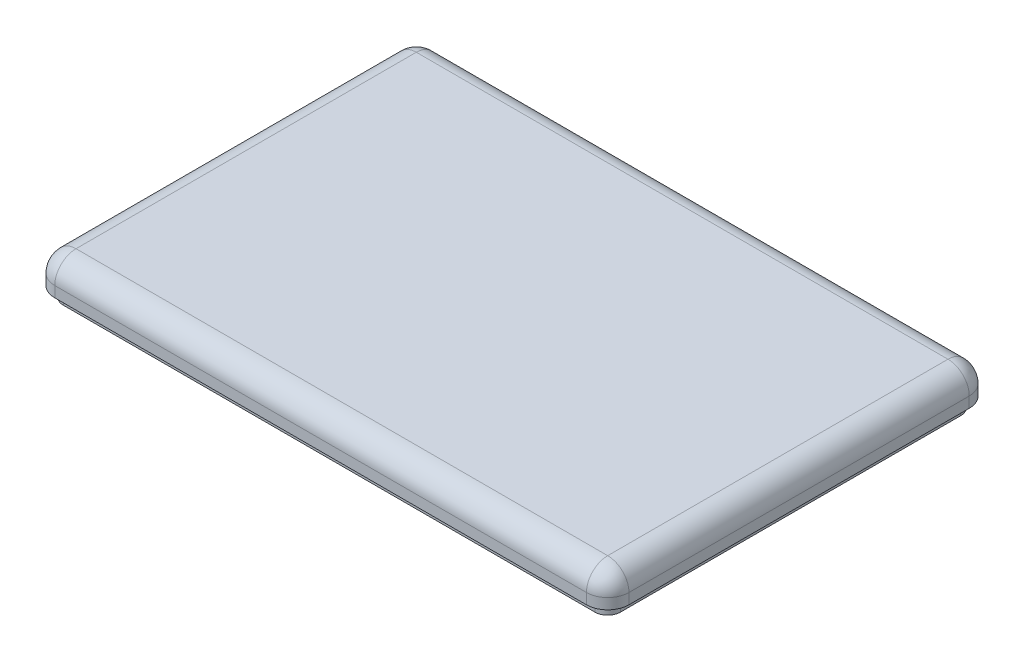
ISO-10303-21;
HEADER;
FILE_DESCRIPTION(('STEP AP214'),'2;1');
FILE_NAME('part.step','',(''),(''),'','','');
FILE_SCHEMA(('AUTOMOTIVE_DESIGN { 1 0 10303 214 1 1 1 1 }'));
ENDSEC;
DATA;
#1=APPLICATION_CONTEXT('core data for automotive mechanical design processes');
#2=APPLICATION_PROTOCOL_DEFINITION('international standard','automotive_design',2000,#1);
#3=PRODUCT_CONTEXT('',#1,'mechanical');
#4=PRODUCT('Part','Part','',(#3));
#5=PRODUCT_RELATED_PRODUCT_CATEGORY('part','',(#4));
#6=PRODUCT_DEFINITION_FORMATION('','',#4);
#7=PRODUCT_DEFINITION_CONTEXT('part definition',#1,'design');
#8=PRODUCT_DEFINITION('design','',#6,#7);
#9=PRODUCT_DEFINITION_SHAPE('','',#8);
#10=(LENGTH_UNIT() NAMED_UNIT(*) SI_UNIT(.MILLI.,.METRE.));
#11=(NAMED_UNIT(*) PLANE_ANGLE_UNIT() SI_UNIT($,.RADIAN.));
#12=(NAMED_UNIT(*) SI_UNIT($,.STERADIAN.) SOLID_ANGLE_UNIT());
#13=UNCERTAINTY_MEASURE_WITH_UNIT(LENGTH_MEASURE(1.E-05),#10,'distance_accuracy_value','');
#14=(GEOMETRIC_REPRESENTATION_CONTEXT(3) GLOBAL_UNCERTAINTY_ASSIGNED_CONTEXT((#13)) GLOBAL_UNIT_ASSIGNED_CONTEXT((#10,
#11,#12)) REPRESENTATION_CONTEXT('',''));
#15=CARTESIAN_POINT('',(0.,0.,0.));
#16=DIRECTION('',(0.,0.,1.));
#17=DIRECTION('',(1.,0.,0.));
#18=AXIS2_PLACEMENT_3D('',#15,#16,#17);
#19=CARTESIAN_POINT('',(135.,20.,90.));
#20=DIRECTION('',(-1.,0.,0.));
#21=DIRECTION('',(0.,0.,1.));
#22=AXIS2_PLACEMENT_3D('',#19,#20,#21);
#23=PLANE('',#22);
#24=DIRECTION('',(0.,0.,1.));
#25=VECTOR('',#24,1.);
#26=CARTESIAN_POINT('',(135.,5.,-80.));
#27=LINE('',#26,#25);
#28=CARTESIAN_POINT('',(135.,5.,-80.));
#29=VERTEX_POINT('',#28);
#30=CARTESIAN_POINT('',(135.,5.,80.));
#31=VERTEX_POINT('',#30);
#32=EDGE_CURVE('E248',#29,#31,#27,.T.);
#33=ORIENTED_EDGE('',*,*,#32,.F.);
#34=DIRECTION('',(0.,-1.,0.));
#35=VECTOR('',#34,1.);
#36=CARTESIAN_POINT('',(135.,20.,-80.));
#37=LINE('',#36,#35);
#38=CARTESIAN_POINT('',(135.,10.,-80.));
#39=VERTEX_POINT('',#38);
#40=EDGE_CURVE('E277',#29,#39,#37,.F.);
#41=ORIENTED_EDGE('',*,*,#40,.T.);
#42=DIRECTION('',(0.,0.,-1.));
#43=VECTOR('',#42,1.);
#44=CARTESIAN_POINT('',(135.,10.,90.));
#45=LINE('',#44,#43);
#46=CARTESIAN_POINT('',(135.,10.,80.));
#47=VERTEX_POINT('',#46);
#48=EDGE_CURVE('E272',#39,#47,#45,.F.);
#49=ORIENTED_EDGE('',*,*,#48,.T.);
#50=DIRECTION('',(0.,-1.,0.));
#51=VECTOR('',#50,1.);
#52=CARTESIAN_POINT('',(135.,20.,80.));
#53=LINE('',#52,#51);
#54=EDGE_CURVE('E274',#47,#31,#53,.T.);
#55=ORIENTED_EDGE('',*,*,#54,.T.);
#56=EDGE_LOOP('',(#33,#41,#49,#55));
#57=FACE_BOUND('',#56,.T.);
#58=ADVANCED_FACE('F35',(#57),#23,.F.);
#59=CARTESIAN_POINT('',(-135.,20.,-90.));
#60=DIRECTION('',(0.,0.,1.));
#61=DIRECTION('',(1.,0.,0.));
#62=AXIS2_PLACEMENT_3D('',#59,#60,#61);
#63=PLANE('',#62);
#64=DIRECTION('',(1.,0.,0.));
#65=VECTOR('',#64,1.);
#66=CARTESIAN_POINT('',(-125.,5.,-90.));
#67=LINE('',#66,#65);
#68=CARTESIAN_POINT('',(-125.,5.,-90.));
#69=VERTEX_POINT('',#68);
#70=CARTESIAN_POINT('',(125.,5.,-90.));
#71=VERTEX_POINT('',#70);
#72=EDGE_CURVE('E244',#69,#71,#67,.T.);
#73=ORIENTED_EDGE('',*,*,#72,.F.);
#74=DIRECTION('',(0.,-1.,0.));
#75=VECTOR('',#74,1.);
#76=CARTESIAN_POINT('',(-125.,20.,-90.));
#77=LINE('',#76,#75);
#78=CARTESIAN_POINT('',(-125.,10.,-90.));
#79=VERTEX_POINT('',#78);
#80=EDGE_CURVE('E270',#69,#79,#77,.F.);
#81=ORIENTED_EDGE('',*,*,#80,.T.);
#82=DIRECTION('',(-1.,0.,0.));
#83=VECTOR('',#82,1.);
#84=CARTESIAN_POINT('',(-135.,10.,-90.));
#85=LINE('',#84,#83);
#86=CARTESIAN_POINT('',(125.,10.,-90.));
#87=VERTEX_POINT('',#86);
#88=EDGE_CURVE('E265',#79,#87,#85,.F.);
#89=ORIENTED_EDGE('',*,*,#88,.T.);
#90=DIRECTION('',(0.,-1.,0.));
#91=VECTOR('',#90,1.);
#92=CARTESIAN_POINT('',(125.,20.,-90.));
#93=LINE('',#92,#91);
#94=EDGE_CURVE('E267',#87,#71,#93,.T.);
#95=ORIENTED_EDGE('',*,*,#94,.T.);
#96=EDGE_LOOP('',(#73,#81,#89,#95));
#97=FACE_BOUND('',#96,.T.);
#98=ADVANCED_FACE('F329',(#97),#63,.F.);
#99=CARTESIAN_POINT('',(-135.,20.,90.));
#100=DIRECTION('',(1.,0.,0.));
#101=DIRECTION('',(0.,0.,-1.));
#102=AXIS2_PLACEMENT_3D('',#99,#100,#101);
#103=PLANE('',#102);
#104=DIRECTION('',(0.,0.,-1.));
#105=VECTOR('',#104,1.);
#106=CARTESIAN_POINT('',(-135.,5.,80.));
#107=LINE('',#106,#105);
#108=CARTESIAN_POINT('',(-135.,5.,80.));
#109=VERTEX_POINT('',#108);
#110=CARTESIAN_POINT('',(-135.,5.,-79.9999999999999));
#111=VERTEX_POINT('',#110);
#112=EDGE_CURVE('E240',#109,#111,#107,.T.);
#113=ORIENTED_EDGE('',*,*,#112,.F.);
#114=DIRECTION('',(0.,-1.,0.));
#115=VECTOR('',#114,1.);
#116=CARTESIAN_POINT('',(-135.,20.,80.));
#117=LINE('',#116,#115);
#118=CARTESIAN_POINT('',(-135.,10.,80.));
#119=VERTEX_POINT('',#118);
#120=EDGE_CURVE('E263',#109,#119,#117,.F.);
#121=ORIENTED_EDGE('',*,*,#120,.T.);
#122=DIRECTION('',(0.,0.,1.));
#123=VECTOR('',#122,1.);
#124=CARTESIAN_POINT('',(-135.,10.,90.));
#125=LINE('',#124,#123);
#126=CARTESIAN_POINT('',(-135.,10.,-80.));
#127=VERTEX_POINT('',#126);
#128=EDGE_CURVE('E258',#119,#127,#125,.F.);
#129=ORIENTED_EDGE('',*,*,#128,.T.);
#130=DIRECTION('',(0.,-1.,0.));
#131=VECTOR('',#130,1.);
#132=CARTESIAN_POINT('',(-135.,20.,-80.));
#133=LINE('',#132,#131);
#134=EDGE_CURVE('E260',#127,#111,#133,.T.);
#135=ORIENTED_EDGE('',*,*,#134,.T.);
#136=EDGE_LOOP('',(#113,#121,#129,#135));
#137=FACE_BOUND('',#136,.T.);
#138=ADVANCED_FACE('F377',(#137),#103,.F.);
#139=CARTESIAN_POINT('',(-135.,20.,90.));
#140=DIRECTION('',(0.,0.,-1.));
#141=DIRECTION('',(-1.,0.,0.));
#142=AXIS2_PLACEMENT_3D('',#139,#140,#141);
#143=PLANE('',#142);
#144=DIRECTION('',(-1.,0.,0.));
#145=VECTOR('',#144,1.);
#146=CARTESIAN_POINT('',(125.,5.,90.));
#147=LINE('',#146,#145);
#148=CARTESIAN_POINT('',(125.,5.,90.));
#149=VERTEX_POINT('',#148);
#150=CARTESIAN_POINT('',(-125.,5.,90.));
#151=VERTEX_POINT('',#150);
#152=EDGE_CURVE('E60',#149,#151,#147,.T.);
#153=ORIENTED_EDGE('',*,*,#152,.F.);
#154=DIRECTION('',(0.,-1.,0.));
#155=VECTOR('',#154,1.);
#156=CARTESIAN_POINT('',(125.,20.,90.));
#157=LINE('',#156,#155);
#158=CARTESIAN_POINT('',(125.,10.,90.));
#159=VERTEX_POINT('',#158);
#160=EDGE_CURVE('E253',#149,#159,#157,.F.);
#161=ORIENTED_EDGE('',*,*,#160,.T.);
#162=DIRECTION('',(1.,0.,0.));
#163=VECTOR('',#162,1.);
#164=CARTESIAN_POINT('',(-135.,10.,90.));
#165=LINE('',#164,#163);
#166=CARTESIAN_POINT('',(-125.,10.,90.));
#167=VERTEX_POINT('',#166);
#168=EDGE_CURVE('E251',#159,#167,#165,.F.);
#169=ORIENTED_EDGE('',*,*,#168,.T.);
#170=DIRECTION('',(0.,-1.,0.));
#171=VECTOR('',#170,1.);
#172=CARTESIAN_POINT('',(-125.,20.,90.));
#173=LINE('',#172,#171);
#174=EDGE_CURVE('E255',#167,#151,#173,.T.);
#175=ORIENTED_EDGE('',*,*,#174,.T.);
#176=EDGE_LOOP('',(#153,#161,#169,#175));
#177=FACE_BOUND('',#176,.T.);
#178=ADVANCED_FACE('F370',(#177),#143,.F.);
#179=CARTESIAN_POINT('',(125.,20.,-80.));
#180=DIRECTION('',(0.,-1.,0.));
#181=DIRECTION('',(0.,0.,-1.));
#182=AXIS2_PLACEMENT_3D('',#179,#180,#181);
#183=CYLINDRICAL_SURFACE('',#182,10.);
#184=ORIENTED_EDGE('',*,*,#40,.F.);
#185=CARTESIAN_POINT('',(125.,5.,-80.));
#186=DIRECTION('',(0.,-1.,0.));
#187=DIRECTION('',(0.,0.,-1.));
#188=AXIS2_PLACEMENT_3D('',#185,#186,#187);
#189=CIRCLE('',#188,10.);
#190=EDGE_CURVE('E246',#71,#29,#189,.T.);
#191=ORIENTED_EDGE('',*,*,#190,.F.);
#192=ORIENTED_EDGE('',*,*,#94,.F.);
#193=CARTESIAN_POINT('',(125.,10.,-80.));
#194=DIRECTION('',(0.,1.,0.));
#195=DIRECTION('',(0.,0.,1.));
#196=AXIS2_PLACEMENT_3D('',#193,#194,#195);
#197=CIRCLE('',#196,10.);
#198=EDGE_CURVE('E39',#39,#87,#197,.T.);
#199=ORIENTED_EDGE('',*,*,#198,.F.);
#200=EDGE_LOOP('',(#184,#191,#192,#199));
#201=FACE_BOUND('',#200,.T.);
#202=ADVANCED_FACE('F37',(#201),#183,.T.);
#203=CARTESIAN_POINT('',(-125.,20.,-80.));
#204=DIRECTION('',(0.,-1.,0.));
#205=DIRECTION('',(0.,0.,-1.));
#206=AXIS2_PLACEMENT_3D('',#203,#204,#205);
#207=CYLINDRICAL_SURFACE('',#206,10.);
#208=ORIENTED_EDGE('',*,*,#80,.F.);
#209=CARTESIAN_POINT('',(-125.,5.,-80.));
#210=DIRECTION('',(0.,-1.,0.));
#211=DIRECTION('',(0.,0.,-1.));
#212=AXIS2_PLACEMENT_3D('',#209,#210,#211);
#213=CIRCLE('',#212,10.);
#214=EDGE_CURVE('E242',#111,#69,#213,.T.);
#215=ORIENTED_EDGE('',*,*,#214,.F.);
#216=ORIENTED_EDGE('',*,*,#134,.F.);
#217=CARTESIAN_POINT('',(-125.,10.,-80.));
#218=DIRECTION('',(0.,1.,0.));
#219=DIRECTION('',(0.,0.,1.));
#220=AXIS2_PLACEMENT_3D('',#217,#218,#219);
#221=CIRCLE('',#220,10.);
#222=EDGE_CURVE('E307',#79,#127,#221,.T.);
#223=ORIENTED_EDGE('',*,*,#222,.F.);
#224=EDGE_LOOP('',(#208,#215,#216,#223));
#225=FACE_BOUND('',#224,.T.);
#226=ADVANCED_FACE('F337',(#225),#207,.T.);
#227=CARTESIAN_POINT('',(125.,20.,80.));
#228=DIRECTION('',(0.,-1.,0.));
#229=DIRECTION('',(0.,0.,-1.));
#230=AXIS2_PLACEMENT_3D('',#227,#228,#229);
#231=CYLINDRICAL_SURFACE('',#230,10.);
#232=ORIENTED_EDGE('',*,*,#160,.F.);
#233=CARTESIAN_POINT('',(125.,5.,80.));
#234=DIRECTION('',(0.,-1.,0.));
#235=DIRECTION('',(0.,0.,-1.));
#236=AXIS2_PLACEMENT_3D('',#233,#234,#235);
#237=CIRCLE('',#236,9.99999999999999);
#238=EDGE_CURVE('E224',#31,#149,#237,.T.);
#239=ORIENTED_EDGE('',*,*,#238,.F.);
#240=ORIENTED_EDGE('',*,*,#54,.F.);
#241=CARTESIAN_POINT('',(125.,10.,80.));
#242=DIRECTION('',(0.,1.,0.));
#243=DIRECTION('',(0.,0.,1.));
#244=AXIS2_PLACEMENT_3D('',#241,#242,#243);
#245=CIRCLE('',#244,10.);
#246=EDGE_CURVE('E298',#159,#47,#245,.T.);
#247=ORIENTED_EDGE('',*,*,#246,.F.);
#248=EDGE_LOOP('',(#232,#239,#240,#247));
#249=FACE_BOUND('',#248,.T.);
#250=ADVANCED_FACE('F368',(#249),#231,.T.);
#251=CARTESIAN_POINT('',(-125.,20.,80.));
#252=DIRECTION('',(0.,-1.,0.));
#253=DIRECTION('',(0.,0.,-1.));
#254=AXIS2_PLACEMENT_3D('',#251,#252,#253);
#255=CYLINDRICAL_SURFACE('',#254,10.);
#256=ORIENTED_EDGE('',*,*,#120,.F.);
#257=CARTESIAN_POINT('',(-125.,5.,80.));
#258=DIRECTION('',(0.,-1.,0.));
#259=DIRECTION('',(0.,0.,-1.));
#260=AXIS2_PLACEMENT_3D('',#257,#258,#259);
#261=CIRCLE('',#260,10.);
#262=EDGE_CURVE('E238',#151,#109,#261,.T.);
#263=ORIENTED_EDGE('',*,*,#262,.F.);
#264=ORIENTED_EDGE('',*,*,#174,.F.);
#265=CARTESIAN_POINT('',(-125.,10.,80.));
#266=DIRECTION('',(0.,1.,0.));
#267=DIRECTION('',(0.,0.,1.));
#268=AXIS2_PLACEMENT_3D('',#265,#266,#267);
#269=CIRCLE('',#268,10.);
#270=EDGE_CURVE('E250',#167,#119,#269,.F.);
#271=ORIENTED_EDGE('',*,*,#270,.T.);
#272=EDGE_LOOP('',(#256,#263,#264,#271));
#273=FACE_BOUND('',#272,.T.);
#274=ADVANCED_FACE('F374',(#273),#255,.T.);
#275=CARTESIAN_POINT('',(0.,20.,0.));
#276=DIRECTION('',(0.,-1.,0.));
#277=DIRECTION('',(0.,0.,-1.));
#278=AXIS2_PLACEMENT_3D('',#275,#276,#277);
#279=PLANE('',#278);
#280=DIRECTION('',(1.,0.,0.));
#281=VECTOR('',#280,1.);
#282=CARTESIAN_POINT('',(0.,20.,80.));
#283=LINE('',#282,#281);
#284=CARTESIAN_POINT('',(-125.,20.,80.));
#285=VERTEX_POINT('',#284);
#286=CARTESIAN_POINT('',(125.,20.,80.));
#287=VERTEX_POINT('',#286);
#288=EDGE_CURVE('E279',#285,#287,#283,.T.);
#289=ORIENTED_EDGE('',*,*,#288,.T.);
#290=DIRECTION('',(0.,0.,-1.));
#291=VECTOR('',#290,1.);
#292=CARTESIAN_POINT('',(125.,20.,0.));
#293=LINE('',#292,#291);
#294=CARTESIAN_POINT('',(125.,20.,-80.));
#295=VERTEX_POINT('',#294);
#296=EDGE_CURVE('E11',#287,#295,#293,.T.);
#297=ORIENTED_EDGE('',*,*,#296,.T.);
#298=DIRECTION('',(-1.,0.,0.));
#299=VECTOR('',#298,1.);
#300=CARTESIAN_POINT('',(0.,20.,-80.));
#301=LINE('',#300,#299);
#302=CARTESIAN_POINT('',(-125.,20.,-80.));
#303=VERTEX_POINT('',#302);
#304=EDGE_CURVE('E44',#295,#303,#301,.T.);
#305=ORIENTED_EDGE('',*,*,#304,.T.);
#306=DIRECTION('',(0.,0.,1.));
#307=VECTOR('',#306,1.);
#308=CARTESIAN_POINT('',(-125.,20.,0.));
#309=LINE('',#308,#307);
#310=EDGE_CURVE('E281',#303,#285,#309,.T.);
#311=ORIENTED_EDGE('',*,*,#310,.T.);
#312=EDGE_LOOP('',(#289,#297,#305,#311));
#313=FACE_BOUND('',#312,.T.);
#314=ADVANCED_FACE('F348',(#313),#279,.F.);
#315=CARTESIAN_POINT('',(125.,10.,-80.));
#316=DIRECTION('',(0.,0.,1.));
#317=DIRECTION('',(1.,0.,0.));
#318=AXIS2_PLACEMENT_3D('',#315,#316,#317);
#319=SPHERICAL_SURFACE('',#318,10.);
#320=CARTESIAN_POINT('',(125.,10.,-80.));
#321=DIRECTION('',(0.,0.,-1.));
#322=DIRECTION('',(-1.,0.,0.));
#323=AXIS2_PLACEMENT_3D('',#320,#321,#322);
#324=CIRCLE('',#323,10.);
#325=EDGE_CURVE('E310',#39,#295,#324,.F.);
#326=ORIENTED_EDGE('',*,*,#325,.F.);
#327=ORIENTED_EDGE('',*,*,#198,.T.);
#328=CARTESIAN_POINT('',(125.,10.,-80.));
#329=DIRECTION('',(1.,0.,0.));
#330=DIRECTION('',(0.,1.,0.));
#331=AXIS2_PLACEMENT_3D('',#328,#329,#330);
#332=CIRCLE('',#331,10.);
#333=EDGE_CURVE('E312',#295,#87,#332,.F.);
#334=ORIENTED_EDGE('',*,*,#333,.F.);
#335=EDGE_LOOP('',(#326,#327,#334));
#336=FACE_BOUND('',#335,.T.);
#337=ADVANCED_FACE('F321',(#336),#319,.T.);
#338=CARTESIAN_POINT('',(0.,10.,-80.));
#339=DIRECTION('',(-1.,0.,0.));
#340=DIRECTION('',(0.,0.,1.));
#341=AXIS2_PLACEMENT_3D('',#338,#339,#340);
#342=CYLINDRICAL_SURFACE('',#341,10.);
#343=ORIENTED_EDGE('',*,*,#333,.T.);
#344=ORIENTED_EDGE('',*,*,#88,.F.);
#345=CARTESIAN_POINT('',(-125.,10.,-80.));
#346=DIRECTION('',(-1.,0.,0.));
#347=DIRECTION('',(0.,0.,1.));
#348=AXIS2_PLACEMENT_3D('',#345,#346,#347);
#349=CIRCLE('',#348,10.);
#350=EDGE_CURVE('E304',#303,#79,#349,.T.);
#351=ORIENTED_EDGE('',*,*,#350,.F.);
#352=ORIENTED_EDGE('',*,*,#304,.F.);
#353=EDGE_LOOP('',(#343,#344,#351,#352));
#354=FACE_BOUND('',#353,.T.);
#355=ADVANCED_FACE('F333',(#354),#342,.T.);
#356=CARTESIAN_POINT('',(125.,10.,0.));
#357=DIRECTION('',(0.,0.,-1.));
#358=DIRECTION('',(-1.,0.,0.));
#359=AXIS2_PLACEMENT_3D('',#356,#357,#358);
#360=CYLINDRICAL_SURFACE('',#359,10.);
#361=ORIENTED_EDGE('',*,*,#325,.T.);
#362=ORIENTED_EDGE('',*,*,#296,.F.);
#363=CARTESIAN_POINT('',(125.,10.,80.));
#364=DIRECTION('',(0.,0.,1.));
#365=DIRECTION('',(1.,0.,0.));
#366=AXIS2_PLACEMENT_3D('',#363,#364,#365);
#367=CIRCLE('',#366,10.);
#368=EDGE_CURVE('E301',#47,#287,#367,.T.);
#369=ORIENTED_EDGE('',*,*,#368,.F.);
#370=ORIENTED_EDGE('',*,*,#48,.F.);
#371=EDGE_LOOP('',(#361,#362,#369,#370));
#372=FACE_BOUND('',#371,.T.);
#373=ADVANCED_FACE('F361',(#372),#360,.T.);
#374=CARTESIAN_POINT('',(-125.,10.,-80.));
#375=DIRECTION('',(0.,0.,1.));
#376=DIRECTION('',(1.,0.,0.));
#377=AXIS2_PLACEMENT_3D('',#374,#375,#376);
#378=SPHERICAL_SURFACE('',#377,10.);
#379=ORIENTED_EDGE('',*,*,#350,.T.);
#380=ORIENTED_EDGE('',*,*,#222,.T.);
#381=CARTESIAN_POINT('',(-125.,10.,-80.));
#382=DIRECTION('',(0.,0.,-1.));
#383=DIRECTION('',(0.,1.,0.));
#384=AXIS2_PLACEMENT_3D('',#381,#382,#383);
#385=CIRCLE('',#384,10.);
#386=EDGE_CURVE('E295',#303,#127,#385,.F.);
#387=ORIENTED_EDGE('',*,*,#386,.F.);
#388=EDGE_LOOP('',(#379,#380,#387));
#389=FACE_BOUND('',#388,.T.);
#390=ADVANCED_FACE('F340',(#389),#378,.T.);
#391=CARTESIAN_POINT('',(125.,10.,80.));
#392=DIRECTION('',(0.,0.,1.));
#393=DIRECTION('',(1.,0.,0.));
#394=AXIS2_PLACEMENT_3D('',#391,#392,#393);
#395=SPHERICAL_SURFACE('',#394,10.);
#396=ORIENTED_EDGE('',*,*,#246,.T.);
#397=ORIENTED_EDGE('',*,*,#368,.T.);
#398=CARTESIAN_POINT('',(125.,10.,80.));
#399=DIRECTION('',(1.,0.,0.));
#400=DIRECTION('',(0.,0.,-1.));
#401=AXIS2_PLACEMENT_3D('',#398,#399,#400);
#402=CIRCLE('',#401,10.);
#403=EDGE_CURVE('E292',#159,#287,#402,.F.);
#404=ORIENTED_EDGE('',*,*,#403,.F.);
#405=EDGE_LOOP('',(#396,#397,#404));
#406=FACE_BOUND('',#405,.T.);
#407=ADVANCED_FACE('F357',(#406),#395,.T.);
#408=CARTESIAN_POINT('',(-125.,10.,0.));
#409=DIRECTION('',(0.,0.,1.));
#410=DIRECTION('',(1.,0.,0.));
#411=AXIS2_PLACEMENT_3D('',#408,#409,#410);
#412=CYLINDRICAL_SURFACE('',#411,10.);
#413=ORIENTED_EDGE('',*,*,#386,.T.);
#414=ORIENTED_EDGE('',*,*,#128,.F.);
#415=CARTESIAN_POINT('',(-125.,10.,80.));
#416=DIRECTION('',(0.,0.,1.));
#417=DIRECTION('',(1.,0.,0.));
#418=AXIS2_PLACEMENT_3D('',#415,#416,#417);
#419=CIRCLE('',#418,10.);
#420=EDGE_CURVE('E289',#285,#119,#419,.T.);
#421=ORIENTED_EDGE('',*,*,#420,.F.);
#422=ORIENTED_EDGE('',*,*,#310,.F.);
#423=EDGE_LOOP('',(#413,#414,#421,#422));
#424=FACE_BOUND('',#423,.T.);
#425=ADVANCED_FACE('F345',(#424),#412,.T.);
#426=CARTESIAN_POINT('',(0.,10.,80.));
#427=DIRECTION('',(1.,0.,0.));
#428=DIRECTION('',(0.,0.,-1.));
#429=AXIS2_PLACEMENT_3D('',#426,#427,#428);
#430=CYLINDRICAL_SURFACE('',#429,10.);
#431=ORIENTED_EDGE('',*,*,#403,.T.);
#432=ORIENTED_EDGE('',*,*,#288,.F.);
#433=CARTESIAN_POINT('',(-125.,10.,80.));
#434=DIRECTION('',(-1.,0.,0.));
#435=DIRECTION('',(0.,0.,1.));
#436=AXIS2_PLACEMENT_3D('',#433,#434,#435);
#437=CIRCLE('',#436,10.);
#438=EDGE_CURVE('E286',#167,#285,#437,.T.);
#439=ORIENTED_EDGE('',*,*,#438,.F.);
#440=ORIENTED_EDGE('',*,*,#168,.F.);
#441=EDGE_LOOP('',(#431,#432,#439,#440));
#442=FACE_BOUND('',#441,.T.);
#443=ADVANCED_FACE('F352',(#442),#430,.T.);
#444=CARTESIAN_POINT('',(-125.,10.,80.));
#445=DIRECTION('',(0.,0.,1.));
#446=DIRECTION('',(1.,0.,0.));
#447=AXIS2_PLACEMENT_3D('',#444,#445,#446);
#448=SPHERICAL_SURFACE('',#447,10.);
#449=ORIENTED_EDGE('',*,*,#438,.T.);
#450=ORIENTED_EDGE('',*,*,#420,.T.);
#451=ORIENTED_EDGE('',*,*,#270,.F.);
#452=EDGE_LOOP('',(#449,#450,#451));
#453=FACE_BOUND('',#452,.T.);
#454=ADVANCED_FACE('F379',(#453),#448,.T.);
#455=CARTESIAN_POINT('',(125.,5.,80.));
#456=DIRECTION('',(0.,-1.,0.));
#457=DIRECTION('',(0.,0.,-1.));
#458=AXIS2_PLACEMENT_3D('',#455,#456,#457);
#459=PLANE('',#458);
#460=DIRECTION('',(-1.,0.,0.));
#461=VECTOR('',#460,1.);
#462=CARTESIAN_POINT('',(125.,5.,86.));
#463=LINE('',#462,#461);
#464=CARTESIAN_POINT('',(125.,5.,86.));
#465=VERTEX_POINT('',#464);
#466=CARTESIAN_POINT('',(-125.,5.,86.));
#467=VERTEX_POINT('',#466);
#468=EDGE_CURVE('E174',#465,#467,#463,.T.);
#469=ORIENTED_EDGE('',*,*,#468,.F.);
#470=CARTESIAN_POINT('',(125.,5.,80.));
#471=DIRECTION('',(0.,-1.,0.));
#472=DIRECTION('',(0.,0.,-1.));
#473=AXIS2_PLACEMENT_3D('',#470,#471,#472);
#474=CIRCLE('',#473,5.99999999999999);
#475=CARTESIAN_POINT('',(131.,5.,80.));
#476=VERTEX_POINT('',#475);
#477=EDGE_CURVE('E204',#476,#465,#474,.T.);
#478=ORIENTED_EDGE('',*,*,#477,.F.);
#479=DIRECTION('',(0.,0.,1.));
#480=VECTOR('',#479,1.);
#481=CARTESIAN_POINT('',(131.,5.,-79.9999999999999));
#482=LINE('',#481,#480);
#483=CARTESIAN_POINT('',(131.,5.,-79.9999999999999));
#484=VERTEX_POINT('',#483);
#485=EDGE_CURVE('E201',#484,#476,#482,.T.);
#486=ORIENTED_EDGE('',*,*,#485,.F.);
#487=CARTESIAN_POINT('',(125.,5.,-80.));
#488=DIRECTION('',(0.,-1.,0.));
#489=DIRECTION('',(0.,0.,-1.));
#490=AXIS2_PLACEMENT_3D('',#487,#488,#489);
#491=CIRCLE('',#490,6.);
#492=CARTESIAN_POINT('',(125.,5.,-86.));
#493=VERTEX_POINT('',#492);
#494=EDGE_CURVE('E198',#493,#484,#491,.T.);
#495=ORIENTED_EDGE('',*,*,#494,.F.);
#496=DIRECTION('',(1.,0.,0.));
#497=VECTOR('',#496,1.);
#498=CARTESIAN_POINT('',(-125.,5.,-86.));
#499=LINE('',#498,#497);
#500=CARTESIAN_POINT('',(-125.,5.,-86.));
#501=VERTEX_POINT('',#500);
#502=EDGE_CURVE('E195',#501,#493,#499,.T.);
#503=ORIENTED_EDGE('',*,*,#502,.F.);
#504=CARTESIAN_POINT('',(-125.,5.,-80.));
#505=DIRECTION('',(0.,-1.,0.));
#506=DIRECTION('',(0.,0.,-1.));
#507=AXIS2_PLACEMENT_3D('',#504,#505,#506);
#508=CIRCLE('',#507,6.00000000000001);
#509=CARTESIAN_POINT('',(-131.,5.,-79.9999999999999));
#510=VERTEX_POINT('',#509);
#511=EDGE_CURVE('E184',#510,#501,#508,.T.);
#512=ORIENTED_EDGE('',*,*,#511,.F.);
#513=DIRECTION('',(0.,0.,-1.));
#514=VECTOR('',#513,1.);
#515=CARTESIAN_POINT('',(-131.,5.,80.));
#516=LINE('',#515,#514);
#517=CARTESIAN_POINT('',(-131.,5.,80.));
#518=VERTEX_POINT('',#517);
#519=EDGE_CURVE('E166',#518,#510,#516,.T.);
#520=ORIENTED_EDGE('',*,*,#519,.F.);
#521=CARTESIAN_POINT('',(-125.,5.,80.));
#522=DIRECTION('',(0.,-1.,0.));
#523=DIRECTION('',(0.,0.,-1.));
#524=AXIS2_PLACEMENT_3D('',#521,#522,#523);
#525=CIRCLE('',#524,6.);
#526=EDGE_CURVE('E180',#467,#518,#525,.T.);
#527=ORIENTED_EDGE('',*,*,#526,.F.);
#528=EDGE_LOOP('',(#469,#478,#486,#495,#503,#512,#520,#527));
#529=FACE_BOUND('',#528,.T.);
#530=ORIENTED_EDGE('',*,*,#238,.T.);
#531=ORIENTED_EDGE('',*,*,#152,.T.);
#532=ORIENTED_EDGE('',*,*,#262,.T.);
#533=ORIENTED_EDGE('',*,*,#112,.T.);
#534=ORIENTED_EDGE('',*,*,#214,.T.);
#535=ORIENTED_EDGE('',*,*,#72,.T.);
#536=ORIENTED_EDGE('',*,*,#190,.T.);
#537=ORIENTED_EDGE('',*,*,#32,.T.);
#538=EDGE_LOOP('',(#530,#531,#532,#533,#534,#535,#536,#537));
#539=FACE_BOUND('',#538,.T.);
#540=ADVANCED_FACE('F179',(#529,#539),#459,.T.);
#541=CARTESIAN_POINT('',(-125.,5.,80.));
#542=DIRECTION('',(0.,-1.,0.));
#543=DIRECTION('',(0.,0.,-1.));
#544=AXIS2_PLACEMENT_3D('',#541,#542,#543);
#545=CYLINDRICAL_SURFACE('',#544,6.);
#546=CARTESIAN_POINT('',(-125.,0.,80.));
#547=DIRECTION('',(0.,-1.,0.));
#548=DIRECTION('',(0.,0.,-1.));
#549=AXIS2_PLACEMENT_3D('',#546,#547,#548);
#550=CIRCLE('',#549,6.);
#551=CARTESIAN_POINT('',(-125.,0.,86.));
#552=VERTEX_POINT('',#551);
#553=CARTESIAN_POINT('',(-131.,0.,80.));
#554=VERTEX_POINT('',#553);
#555=EDGE_CURVE('E208',#552,#554,#550,.T.);
#556=ORIENTED_EDGE('',*,*,#555,.F.);
#557=DIRECTION('',(0.,-1.,0.));
#558=VECTOR('',#557,1.);
#559=CARTESIAN_POINT('',(-125.,5.,86.));
#560=LINE('',#559,#558);
#561=EDGE_CURVE('E187',#467,#552,#560,.T.);
#562=ORIENTED_EDGE('',*,*,#561,.F.);
#563=ORIENTED_EDGE('',*,*,#526,.T.);
#564=DIRECTION('',(0.,-1.,0.));
#565=VECTOR('',#564,1.);
#566=CARTESIAN_POINT('',(-131.,5.,80.));
#567=LINE('',#566,#565);
#568=EDGE_CURVE('E163',#518,#554,#567,.T.);
#569=ORIENTED_EDGE('',*,*,#568,.T.);
#570=EDGE_LOOP('',(#556,#562,#563,#569));
#571=FACE_BOUND('',#570,.T.);
#572=ADVANCED_FACE('F186',(#571),#545,.T.);
#573=CARTESIAN_POINT('',(125.,5.,86.));
#574=DIRECTION('',(0.,0.,1.));
#575=DIRECTION('',(1.,0.,0.));
#576=AXIS2_PLACEMENT_3D('',#573,#574,#575);
#577=PLANE('',#576);
#578=DIRECTION('',(-1.,0.,0.));
#579=VECTOR('',#578,1.);
#580=CARTESIAN_POINT('',(125.,0.,86.));
#581=LINE('',#580,#579);
#582=CARTESIAN_POINT('',(125.,0.,86.));
#583=VERTEX_POINT('',#582);
#584=EDGE_CURVE('E188',#583,#552,#581,.T.);
#585=ORIENTED_EDGE('',*,*,#584,.F.);
#586=DIRECTION('',(0.,-1.,0.));
#587=VECTOR('',#586,1.);
#588=CARTESIAN_POINT('',(125.,5.,86.));
#589=LINE('',#588,#587);
#590=EDGE_CURVE('E225',#465,#583,#589,.T.);
#591=ORIENTED_EDGE('',*,*,#590,.F.);
#592=ORIENTED_EDGE('',*,*,#468,.T.);
#593=ORIENTED_EDGE('',*,*,#561,.T.);
#594=EDGE_LOOP('',(#585,#591,#592,#593));
#595=FACE_BOUND('',#594,.T.);
#596=ADVANCED_FACE('F512',(#595),#577,.T.);
#597=CARTESIAN_POINT('',(125.,5.,80.));
#598=DIRECTION('',(0.,-1.,0.));
#599=DIRECTION('',(0.,0.,-1.));
#600=AXIS2_PLACEMENT_3D('',#597,#598,#599);
#601=CYLINDRICAL_SURFACE('',#600,5.99999999999999);
#602=CARTESIAN_POINT('',(125.,0.,80.));
#603=DIRECTION('',(0.,-1.,0.));
#604=DIRECTION('',(0.,0.,-1.));
#605=AXIS2_PLACEMENT_3D('',#602,#603,#604);
#606=CIRCLE('',#605,5.99999999999999);
#607=CARTESIAN_POINT('',(131.,0.,80.));
#608=VERTEX_POINT('',#607);
#609=EDGE_CURVE('E191',#608,#583,#606,.T.);
#610=ORIENTED_EDGE('',*,*,#609,.F.);
#611=DIRECTION('',(0.,-1.,0.));
#612=VECTOR('',#611,1.);
#613=CARTESIAN_POINT('',(131.,5.,80.));
#614=LINE('',#613,#612);
#615=EDGE_CURVE('E227',#476,#608,#614,.T.);
#616=ORIENTED_EDGE('',*,*,#615,.F.);
#617=ORIENTED_EDGE('',*,*,#477,.T.);
#618=ORIENTED_EDGE('',*,*,#590,.T.);
#619=EDGE_LOOP('',(#610,#616,#617,#618));
#620=FACE_BOUND('',#619,.T.);
#621=ADVANCED_FACE('F521',(#620),#601,.T.);
#622=CARTESIAN_POINT('',(131.,5.,-79.9999999999999));
#623=DIRECTION('',(1.,0.,0.));
#624=DIRECTION('',(0.,0.,-1.));
#625=AXIS2_PLACEMENT_3D('',#622,#623,#624);
#626=PLANE('',#625);
#627=DIRECTION('',(0.,0.,1.));
#628=VECTOR('',#627,1.);
#629=CARTESIAN_POINT('',(131.,0.,-79.9999999999999));
#630=LINE('',#629,#628);
#631=CARTESIAN_POINT('',(131.,0.,-79.9999999999999));
#632=VERTEX_POINT('',#631);
#633=EDGE_CURVE('E218',#632,#608,#630,.T.);
#634=ORIENTED_EDGE('',*,*,#633,.F.);
#635=DIRECTION('',(0.,-1.,0.));
#636=VECTOR('',#635,1.);
#637=CARTESIAN_POINT('',(131.,5.,-79.9999999999999));
#638=LINE('',#637,#636);
#639=EDGE_CURVE('E229',#484,#632,#638,.T.);
#640=ORIENTED_EDGE('',*,*,#639,.F.);
#641=ORIENTED_EDGE('',*,*,#485,.T.);
#642=ORIENTED_EDGE('',*,*,#615,.T.);
#643=EDGE_LOOP('',(#634,#640,#641,#642));
#644=FACE_BOUND('',#643,.T.);
#645=ADVANCED_FACE('F531',(#644),#626,.T.);
#646=CARTESIAN_POINT('',(125.,5.,-80.));
#647=DIRECTION('',(0.,-1.,0.));
#648=DIRECTION('',(0.,0.,-1.));
#649=AXIS2_PLACEMENT_3D('',#646,#647,#648);
#650=CYLINDRICAL_SURFACE('',#649,6.);
#651=CARTESIAN_POINT('',(125.,0.,-80.));
#652=DIRECTION('',(0.,-1.,0.));
#653=DIRECTION('',(0.,0.,-1.));
#654=AXIS2_PLACEMENT_3D('',#651,#652,#653);
#655=CIRCLE('',#654,6.);
#656=CARTESIAN_POINT('',(125.,0.,-86.));
#657=VERTEX_POINT('',#656);
#658=EDGE_CURVE('E215',#657,#632,#655,.T.);
#659=ORIENTED_EDGE('',*,*,#658,.F.);
#660=DIRECTION('',(0.,-1.,0.));
#661=VECTOR('',#660,1.);
#662=CARTESIAN_POINT('',(125.,5.,-86.));
#663=LINE('',#662,#661);
#664=EDGE_CURVE('E231',#493,#657,#663,.T.);
#665=ORIENTED_EDGE('',*,*,#664,.F.);
#666=ORIENTED_EDGE('',*,*,#494,.T.);
#667=ORIENTED_EDGE('',*,*,#639,.T.);
#668=EDGE_LOOP('',(#659,#665,#666,#667));
#669=FACE_BOUND('',#668,.T.);
#670=ADVANCED_FACE('F541',(#669),#650,.T.);
#671=CARTESIAN_POINT('',(-125.,5.,-86.));
#672=DIRECTION('',(0.,0.,-1.));
#673=DIRECTION('',(-1.,0.,0.));
#674=AXIS2_PLACEMENT_3D('',#671,#672,#673);
#675=PLANE('',#674);
#676=DIRECTION('',(1.,0.,0.));
#677=VECTOR('',#676,1.);
#678=CARTESIAN_POINT('',(-125.,0.,-86.));
#679=LINE('',#678,#677);
#680=CARTESIAN_POINT('',(-125.,0.,-86.));
#681=VERTEX_POINT('',#680);
#682=EDGE_CURVE('E212',#681,#657,#679,.T.);
#683=ORIENTED_EDGE('',*,*,#682,.F.);
#684=DIRECTION('',(0.,-1.,0.));
#685=VECTOR('',#684,1.);
#686=CARTESIAN_POINT('',(-125.,5.,-86.));
#687=LINE('',#686,#685);
#688=EDGE_CURVE('E233',#501,#681,#687,.T.);
#689=ORIENTED_EDGE('',*,*,#688,.F.);
#690=ORIENTED_EDGE('',*,*,#502,.T.);
#691=ORIENTED_EDGE('',*,*,#664,.T.);
#692=EDGE_LOOP('',(#683,#689,#690,#691));
#693=FACE_BOUND('',#692,.T.);
#694=ADVANCED_FACE('F551',(#693),#675,.T.);
#695=CARTESIAN_POINT('',(-125.,5.,-80.));
#696=DIRECTION('',(0.,-1.,0.));
#697=DIRECTION('',(0.,0.,-1.));
#698=AXIS2_PLACEMENT_3D('',#695,#696,#697);
#699=CYLINDRICAL_SURFACE('',#698,6.00000000000001);
#700=CARTESIAN_POINT('',(-125.,0.,-80.));
#701=DIRECTION('',(0.,-1.,0.));
#702=DIRECTION('',(0.,0.,-1.));
#703=AXIS2_PLACEMENT_3D('',#700,#701,#702);
#704=CIRCLE('',#703,6.00000000000001);
#705=CARTESIAN_POINT('',(-131.,0.,-79.9999999999999));
#706=VERTEX_POINT('',#705);
#707=EDGE_CURVE('E52',#706,#681,#704,.T.);
#708=ORIENTED_EDGE('',*,*,#707,.F.);
#709=DIRECTION('',(0.,-1.,0.));
#710=VECTOR('',#709,1.);
#711=CARTESIAN_POINT('',(-131.,5.,-79.9999999999999));
#712=LINE('',#711,#710);
#713=EDGE_CURVE('E173',#510,#706,#712,.T.);
#714=ORIENTED_EDGE('',*,*,#713,.F.);
#715=ORIENTED_EDGE('',*,*,#511,.T.);
#716=ORIENTED_EDGE('',*,*,#688,.T.);
#717=EDGE_LOOP('',(#708,#714,#715,#716));
#718=FACE_BOUND('',#717,.T.);
#719=ADVANCED_FACE('F561',(#718),#699,.T.);
#720=CARTESIAN_POINT('',(-131.,5.,80.));
#721=DIRECTION('',(-1.,0.,0.));
#722=DIRECTION('',(0.,0.,1.));
#723=AXIS2_PLACEMENT_3D('',#720,#721,#722);
#724=PLANE('',#723);
#725=DIRECTION('',(0.,0.,-1.));
#726=VECTOR('',#725,1.);
#727=CARTESIAN_POINT('',(-131.,0.,80.));
#728=LINE('',#727,#726);
#729=EDGE_CURVE('E168',#554,#706,#728,.T.);
#730=ORIENTED_EDGE('',*,*,#729,.F.);
#731=ORIENTED_EDGE('',*,*,#568,.F.);
#732=ORIENTED_EDGE('',*,*,#519,.T.);
#733=ORIENTED_EDGE('',*,*,#713,.T.);
#734=EDGE_LOOP('',(#730,#731,#732,#733));
#735=FACE_BOUND('',#734,.T.);
#736=ADVANCED_FACE('F165',(#735),#724,.T.);
#737=CARTESIAN_POINT('',(0.,0.,0.));
#738=DIRECTION('',(0.,-1.,0.));
#739=DIRECTION('',(0.,0.,-1.));
#740=AXIS2_PLACEMENT_3D('',#737,#738,#739);
#741=PLANE('',#740);
#742=ORIENTED_EDGE('',*,*,#584,.T.);
#743=ORIENTED_EDGE('',*,*,#555,.T.);
#744=ORIENTED_EDGE('',*,*,#729,.T.);
#745=ORIENTED_EDGE('',*,*,#707,.T.);
#746=ORIENTED_EDGE('',*,*,#682,.T.);
#747=ORIENTED_EDGE('',*,*,#658,.T.);
#748=ORIENTED_EDGE('',*,*,#633,.T.);
#749=ORIENTED_EDGE('',*,*,#609,.T.);
#750=EDGE_LOOP('',(#742,#743,#744,#745,#746,#747,#748,#749));
#751=FACE_BOUND('',#750,.T.);
#752=ADVANCED_FACE('F579',(#751),#741,.T.);
#753=CLOSED_SHELL('',(#58,#98,#138,#178,#202,#226,#250,#274,#314,#337,#355,#373,#390,#407,#425,
#443,#454,#540,#572,#596,#621,#645,#670,#694,#719,#736,#752));
#754=MANIFOLD_SOLID_BREP('B2',#753);
#755=ADVANCED_BREP_SHAPE_REPRESENTATION('',(#18,#754),#14);
#756=SHAPE_DEFINITION_REPRESENTATION(#9,#755);
ENDSEC;
END-ISO-10303-21;
